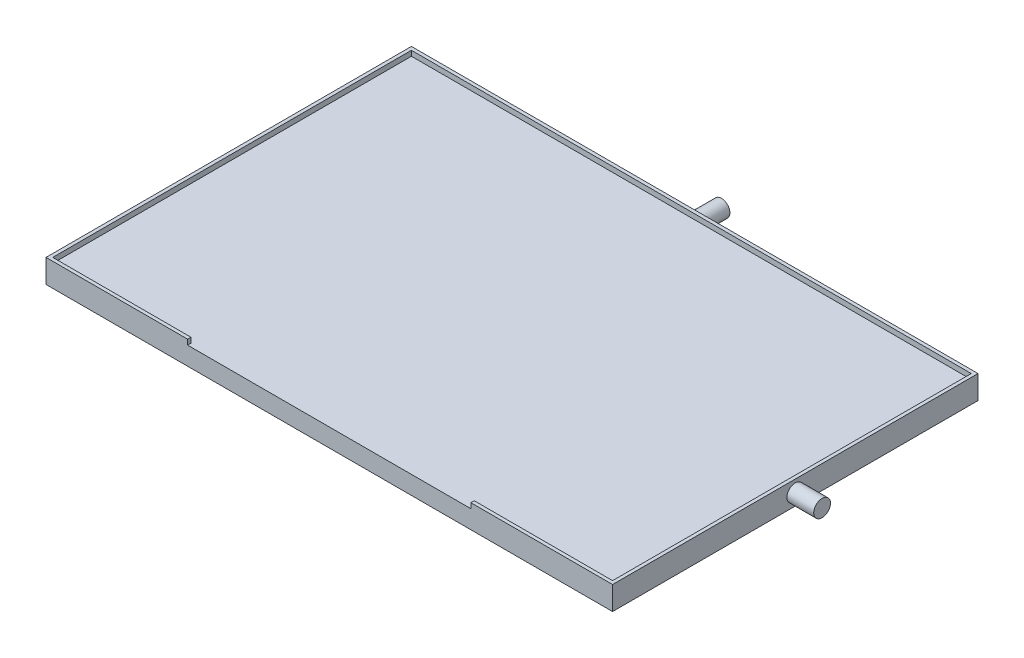
ISO-10303-21;
HEADER;
FILE_DESCRIPTION(('STEP AP214'),'2;1');
FILE_NAME('part.step','',(''),(''),'','','');
FILE_SCHEMA(('AUTOMOTIVE_DESIGN { 1 0 10303 214 1 1 1 1 }'));
ENDSEC;
DATA;
#1=APPLICATION_CONTEXT('core data for automotive mechanical design processes');
#2=APPLICATION_PROTOCOL_DEFINITION('international standard','automotive_design',2000,#1);
#3=PRODUCT_CONTEXT('',#1,'mechanical');
#4=PRODUCT('Part','Part','',(#3));
#5=PRODUCT_RELATED_PRODUCT_CATEGORY('part','',(#4));
#6=PRODUCT_DEFINITION_FORMATION('','',#4);
#7=PRODUCT_DEFINITION_CONTEXT('part definition',#1,'design');
#8=PRODUCT_DEFINITION('design','',#6,#7);
#9=PRODUCT_DEFINITION_SHAPE('','',#8);
#10=(LENGTH_UNIT() NAMED_UNIT(*) SI_UNIT(.MILLI.,.METRE.));
#11=(NAMED_UNIT(*) PLANE_ANGLE_UNIT() SI_UNIT($,.RADIAN.));
#12=(NAMED_UNIT(*) SI_UNIT($,.STERADIAN.) SOLID_ANGLE_UNIT());
#13=UNCERTAINTY_MEASURE_WITH_UNIT(LENGTH_MEASURE(1.E-05),#10,'distance_accuracy_value','');
#14=(GEOMETRIC_REPRESENTATION_CONTEXT(3) GLOBAL_UNCERTAINTY_ASSIGNED_CONTEXT((#13)) GLOBAL_UNIT_ASSIGNED_CONTEXT((#10,
#11,#12)) REPRESENTATION_CONTEXT('',''));
#15=CARTESIAN_POINT('',(0.,0.,0.));
#16=DIRECTION('',(0.,0.,1.));
#17=DIRECTION('',(1.,0.,0.));
#18=AXIS2_PLACEMENT_3D('',#15,#16,#17);
#19=CARTESIAN_POINT('',(0.,-10.,0.));
#20=DIRECTION('',(0.,1.,0.));
#21=DIRECTION('',(0.,0.,1.));
#22=AXIS2_PLACEMENT_3D('',#19,#20,#21);
#23=PLANE('',#22);
#24=DIRECTION('',(-1.,0.,0.));
#25=VECTOR('',#24,1.);
#26=CARTESIAN_POINT('',(104.6,-10.,-57.05));
#27=LINE('',#26,#25);
#28=CARTESIAN_POINT('',(99.5,-10.,-57.05));
#29=VERTEX_POINT('',#28);
#30=CARTESIAN_POINT('',(104.6,-10.,-57.05));
#31=VERTEX_POINT('',#30);
#32=EDGE_CURVE('E255',#29,#31,#27,.F.);
#33=ORIENTED_EDGE('',*,*,#32,.F.);
#34=DIRECTION('',(0.,0.,-1.));
#35=VECTOR('',#34,1.);
#36=CARTESIAN_POINT('',(99.5,-10.,-62.));
#37=LINE('',#36,#35);
#38=CARTESIAN_POINT('',(99.5,-10.,-62.));
#39=VERTEX_POINT('',#38);
#40=EDGE_CURVE('E295',#29,#39,#37,.T.);
#41=ORIENTED_EDGE('',*,*,#40,.T.);
#42=DIRECTION('',(1.,0.,0.));
#43=VECTOR('',#42,1.);
#44=CARTESIAN_POINT('',(99.5,-10.,-62.));
#45=LINE('',#44,#43);
#46=CARTESIAN_POINT('',(109.5,-10.,-62.));
#47=VERTEX_POINT('',#46);
#48=EDGE_CURVE('E299',#39,#47,#45,.T.);
#49=ORIENTED_EDGE('',*,*,#48,.T.);
#50=DIRECTION('',(0.,0.,1.));
#51=VECTOR('',#50,1.);
#52=CARTESIAN_POINT('',(109.5,-10.,-62.));
#53=LINE('',#52,#51);
#54=CARTESIAN_POINT('',(109.5,-10.,-47.));
#55=VERTEX_POINT('',#54);
#56=EDGE_CURVE('E289',#47,#55,#53,.T.);
#57=ORIENTED_EDGE('',*,*,#56,.T.);
#58=DIRECTION('',(-1.,0.,0.));
#59=VECTOR('',#58,1.);
#60=CARTESIAN_POINT('',(99.5,-10.,-47.));
#61=LINE('',#60,#59);
#62=CARTESIAN_POINT('',(99.5,-10.,-47.));
#63=VERTEX_POINT('',#62);
#64=EDGE_CURVE('E292',#55,#63,#61,.T.);
#65=ORIENTED_EDGE('',*,*,#64,.T.);
#66=CARTESIAN_POINT('',(99.5,-10.,-51.95));
#67=VERTEX_POINT('',#66);
#68=EDGE_CURVE('E296',#63,#67,#37,.T.);
#69=ORIENTED_EDGE('',*,*,#68,.T.);
#70=DIRECTION('',(-1.,0.,0.));
#71=VECTOR('',#70,1.);
#72=CARTESIAN_POINT('',(104.6,-10.,-51.95));
#73=LINE('',#72,#71);
#74=CARTESIAN_POINT('',(104.6,-10.,-51.95));
#75=VERTEX_POINT('',#74);
#76=EDGE_CURVE('E251',#75,#67,#73,.T.);
#77=ORIENTED_EDGE('',*,*,#76,.F.);
#78=DIRECTION('',(0.,0.,-1.));
#79=VECTOR('',#78,1.);
#80=CARTESIAN_POINT('',(104.6,-10.,0.));
#81=LINE('',#80,#79);
#82=EDGE_CURVE('E11',#75,#31,#81,.T.);
#83=ORIENTED_EDGE('',*,*,#82,.T.);
#84=EDGE_LOOP('',(#33,#41,#49,#57,#65,#69,#77,#83));
#85=FACE_BOUND('',#84,.T.);
#86=ADVANCED_FACE('F35',(#85),#23,.F.);
#87=CARTESIAN_POINT('',(0.,-10.,0.));
#88=DIRECTION('',(0.,-1.,0.));
#89=DIRECTION('',(0.,0.,-1.));
#90=AXIS2_PLACEMENT_3D('',#87,#88,#89);
#91=PLANE('',#90);
#92=DIRECTION('',(0.,0.,1.));
#93=VECTOR('',#92,1.);
#94=CARTESIAN_POINT('',(64.4,-10.,0.));
#95=LINE('',#94,#93);
#96=CARTESIAN_POINT('',(64.4,-10.,-57.05));
#97=VERTEX_POINT('',#96);
#98=CARTESIAN_POINT('',(64.4,-10.,-51.95));
#99=VERTEX_POINT('',#98);
#100=EDGE_CURVE('E377',#97,#99,#95,.T.);
#101=ORIENTED_EDGE('',*,*,#100,.T.);
#102=DIRECTION('',(-1.,0.,0.));
#103=VECTOR('',#102,1.);
#104=CARTESIAN_POINT('',(104.6,-10.,-51.95));
#105=LINE('',#104,#103);
#106=CARTESIAN_POINT('',(69.5,-10.,-51.95));
#107=VERTEX_POINT('',#106);
#108=EDGE_CURVE('E43',#99,#107,#105,.F.);
#109=ORIENTED_EDGE('',*,*,#108,.T.);
#110=DIRECTION('',(0.,0.,1.));
#111=VECTOR('',#110,1.);
#112=CARTESIAN_POINT('',(69.5,-10.,-62.));
#113=LINE('',#112,#111);
#114=CARTESIAN_POINT('',(69.5,-10.,-47.));
#115=VERTEX_POINT('',#114);
#116=EDGE_CURVE('E264',#107,#115,#113,.T.);
#117=ORIENTED_EDGE('',*,*,#116,.T.);
#118=DIRECTION('',(-1.,0.,0.));
#119=VECTOR('',#118,1.);
#120=CARTESIAN_POINT('',(69.5,-10.,-47.));
#121=LINE('',#120,#119);
#122=CARTESIAN_POINT('',(59.5,-10.,-47.));
#123=VERTEX_POINT('',#122);
#124=EDGE_CURVE('E268',#115,#123,#121,.T.);
#125=ORIENTED_EDGE('',*,*,#124,.T.);
#126=DIRECTION('',(0.,0.,-1.));
#127=VECTOR('',#126,1.);
#128=CARTESIAN_POINT('',(59.5,-10.,-62.));
#129=LINE('',#128,#127);
#130=CARTESIAN_POINT('',(59.5,-10.,-62.));
#131=VERTEX_POINT('',#130);
#132=EDGE_CURVE('E258',#123,#131,#129,.T.);
#133=ORIENTED_EDGE('',*,*,#132,.T.);
#134=DIRECTION('',(1.,0.,0.));
#135=VECTOR('',#134,1.);
#136=CARTESIAN_POINT('',(69.5,-10.,-62.));
#137=LINE('',#136,#135);
#138=CARTESIAN_POINT('',(69.5,-10.,-62.));
#139=VERTEX_POINT('',#138);
#140=EDGE_CURVE('E261',#131,#139,#137,.T.);
#141=ORIENTED_EDGE('',*,*,#140,.T.);
#142=CARTESIAN_POINT('',(69.5,-10.,-57.05));
#143=VERTEX_POINT('',#142);
#144=EDGE_CURVE('E265',#139,#143,#113,.T.);
#145=ORIENTED_EDGE('',*,*,#144,.T.);
#146=DIRECTION('',(-1.,0.,0.));
#147=VECTOR('',#146,1.);
#148=CARTESIAN_POINT('',(104.6,-10.,-57.05));
#149=LINE('',#148,#147);
#150=EDGE_CURVE('E385',#143,#97,#149,.T.);
#151=ORIENTED_EDGE('',*,*,#150,.T.);
#152=EDGE_LOOP('',(#101,#109,#117,#125,#133,#141,#145,#151));
#153=FACE_BOUND('',#152,.T.);
#154=ADVANCED_FACE('F390',(#153),#91,.T.);
#155=CARTESIAN_POINT('',(0.,0.,-109.));
#156=DIRECTION('',(0.,-1.,0.));
#157=DIRECTION('',(0.,0.,-1.));
#158=AXIS2_PLACEMENT_3D('',#155,#156,#157);
#159=PLANE('',#158);
#160=DIRECTION('',(1.,0.,0.));
#161=VECTOR('',#160,1.);
#162=CARTESIAN_POINT('',(0.,0.,0.));
#163=LINE('',#162,#161);
#164=CARTESIAN_POINT('',(0.,0.,0.));
#165=VERTEX_POINT('',#164);
#166=CARTESIAN_POINT('',(169.,0.,0.));
#167=VERTEX_POINT('',#166);
#168=EDGE_CURVE('E365',#165,#167,#163,.T.);
#169=ORIENTED_EDGE('',*,*,#168,.F.);
#170=DIRECTION('',(0.,0.,1.));
#171=VECTOR('',#170,1.);
#172=CARTESIAN_POINT('',(0.,0.,-109.));
#173=LINE('',#172,#171);
#174=CARTESIAN_POINT('',(0.,0.,-109.));
#175=VERTEX_POINT('',#174);
#176=EDGE_CURVE('E362',#175,#165,#173,.T.);
#177=ORIENTED_EDGE('',*,*,#176,.F.);
#178=DIRECTION('',(1.,0.,0.));
#179=VECTOR('',#178,1.);
#180=CARTESIAN_POINT('',(0.,0.,-109.));
#181=LINE('',#180,#179);
#182=CARTESIAN_POINT('',(169.,0.,-109.));
#183=VERTEX_POINT('',#182);
#184=EDGE_CURVE('E352',#175,#183,#181,.T.);
#185=ORIENTED_EDGE('',*,*,#184,.T.);
#186=DIRECTION('',(0.,0.,1.));
#187=VECTOR('',#186,1.);
#188=CARTESIAN_POINT('',(169.,0.,-109.));
#189=LINE('',#188,#187);
#190=EDGE_CURVE('E380',#183,#167,#189,.T.);
#191=ORIENTED_EDGE('',*,*,#190,.T.);
#192=EDGE_LOOP('',(#169,#177,#185,#191));
#193=FACE_BOUND('',#192,.T.);
#194=DIRECTION('',(-1.,0.,0.));
#195=VECTOR('',#194,1.);
#196=CARTESIAN_POINT('',(99.5,0.,-47.));
#197=LINE('',#196,#195);
#198=CARTESIAN_POINT('',(109.5,0.,-47.));
#199=VERTEX_POINT('',#198);
#200=CARTESIAN_POINT('',(99.5,0.,-47.));
#201=VERTEX_POINT('',#200);
#202=EDGE_CURVE('E304',#199,#201,#197,.T.);
#203=ORIENTED_EDGE('',*,*,#202,.F.);
#204=DIRECTION('',(0.,0.,1.));
#205=VECTOR('',#204,1.);
#206=CARTESIAN_POINT('',(109.5,0.,-62.));
#207=LINE('',#206,#205);
#208=CARTESIAN_POINT('',(109.5,0.,-62.));
#209=VERTEX_POINT('',#208);
#210=EDGE_CURVE('E288',#209,#199,#207,.T.);
#211=ORIENTED_EDGE('',*,*,#210,.F.);
#212=DIRECTION('',(1.,0.,0.));
#213=VECTOR('',#212,1.);
#214=CARTESIAN_POINT('',(99.5,0.,-62.));
#215=LINE('',#214,#213);
#216=CARTESIAN_POINT('',(99.5,0.,-62.));
#217=VERTEX_POINT('',#216);
#218=EDGE_CURVE('E293',#217,#209,#215,.T.);
#219=ORIENTED_EDGE('',*,*,#218,.F.);
#220=DIRECTION('',(0.,0.,-1.));
#221=VECTOR('',#220,1.);
#222=CARTESIAN_POINT('',(99.5,0.,-62.));
#223=LINE('',#222,#221);
#224=EDGE_CURVE('E306',#201,#217,#223,.T.);
#225=ORIENTED_EDGE('',*,*,#224,.F.);
#226=EDGE_LOOP('',(#203,#211,#219,#225));
#227=FACE_BOUND('',#226,.T.);
#228=DIRECTION('',(1.,0.,0.));
#229=VECTOR('',#228,1.);
#230=CARTESIAN_POINT('',(69.5,0.,-62.));
#231=LINE('',#230,#229);
#232=CARTESIAN_POINT('',(59.5,0.,-62.));
#233=VERTEX_POINT('',#232);
#234=CARTESIAN_POINT('',(69.5,0.,-62.));
#235=VERTEX_POINT('',#234);
#236=EDGE_CURVE('E273',#233,#235,#231,.T.);
#237=ORIENTED_EDGE('',*,*,#236,.F.);
#238=DIRECTION('',(0.,0.,-1.));
#239=VECTOR('',#238,1.);
#240=CARTESIAN_POINT('',(59.5,0.,-62.));
#241=LINE('',#240,#239);
#242=CARTESIAN_POINT('',(59.5,0.,-47.));
#243=VERTEX_POINT('',#242);
#244=EDGE_CURVE('E257',#243,#233,#241,.T.);
#245=ORIENTED_EDGE('',*,*,#244,.F.);
#246=DIRECTION('',(-1.,0.,0.));
#247=VECTOR('',#246,1.);
#248=CARTESIAN_POINT('',(69.5,0.,-47.));
#249=LINE('',#248,#247);
#250=CARTESIAN_POINT('',(69.5,0.,-47.));
#251=VERTEX_POINT('',#250);
#252=EDGE_CURVE('E262',#251,#243,#249,.T.);
#253=ORIENTED_EDGE('',*,*,#252,.F.);
#254=DIRECTION('',(0.,0.,1.));
#255=VECTOR('',#254,1.);
#256=CARTESIAN_POINT('',(69.5,0.,-62.));
#257=LINE('',#256,#255);
#258=EDGE_CURVE('E275',#235,#251,#257,.T.);
#259=ORIENTED_EDGE('',*,*,#258,.F.);
#260=EDGE_LOOP('',(#237,#245,#253,#259));
#261=FACE_BOUND('',#260,.T.);
#262=ADVANCED_FACE('F434',(#193,#227,#261),#159,.T.);
#263=CARTESIAN_POINT('',(0.,0.,-109.));
#264=DIRECTION('',(-1.,0.,0.));
#265=DIRECTION('',(0.,0.,1.));
#266=AXIS2_PLACEMENT_3D('',#263,#264,#265);
#267=PLANE('',#266);
#268=DIRECTION('',(0.,-1.,0.));
#269=VECTOR('',#268,1.);
#270=CARTESIAN_POINT('',(0.,0.,0.));
#271=LINE('',#270,#269);
#272=CARTESIAN_POINT('',(0.,7.00000000000001,0.));
#273=VERTEX_POINT('',#272);
#274=EDGE_CURVE('E343',#273,#165,#271,.T.);
#275=ORIENTED_EDGE('',*,*,#274,.F.);
#276=DIRECTION('',(0.,0.,1.));
#277=VECTOR('',#276,1.);
#278=CARTESIAN_POINT('',(0.,7.00000000000001,-109.));
#279=LINE('',#278,#277);
#280=CARTESIAN_POINT('',(0.,7.00000000000001,-109.));
#281=VERTEX_POINT('',#280);
#282=EDGE_CURVE('E374',#281,#273,#279,.T.);
#283=ORIENTED_EDGE('',*,*,#282,.F.);
#284=DIRECTION('',(0.,-1.,0.));
#285=VECTOR('',#284,1.);
#286=CARTESIAN_POINT('',(0.,0.,-109.));
#287=LINE('',#286,#285);
#288=EDGE_CURVE('E349',#281,#175,#287,.T.);
#289=ORIENTED_EDGE('',*,*,#288,.T.);
#290=ORIENTED_EDGE('',*,*,#176,.T.);
#291=EDGE_LOOP('',(#275,#283,#289,#290));
#292=FACE_BOUND('',#291,.T.);
#293=ADVANCED_FACE('F37',(#292),#267,.T.);
#294=CARTESIAN_POINT('',(0.,7.00000000000001,-109.));
#295=DIRECTION('',(0.,1.,0.));
#296=DIRECTION('',(-1.,0.,0.));
#297=AXIS2_PLACEMENT_3D('',#294,#295,#296);
#298=PLANE('',#297);
#299=DIRECTION('',(1.,0.,0.));
#300=VECTOR('',#299,1.);
#301=CARTESIAN_POINT('',(0.999999999999987,7.00000000000001,-1.00000000000001));
#302=LINE('',#301,#300);
#303=CARTESIAN_POINT('',(126.75,7.,-1.00000000000001));
#304=VERTEX_POINT('',#303);
#305=CARTESIAN_POINT('',(168.,7.,-1.00000000000001));
#306=VERTEX_POINT('',#305);
#307=EDGE_CURVE('E233',#304,#306,#302,.T.);
#308=ORIENTED_EDGE('',*,*,#307,.F.);
#309=DIRECTION('',(0.,0.,1.));
#310=VECTOR('',#309,1.);
#311=CARTESIAN_POINT('',(126.75,7.,-2.));
#312=LINE('',#311,#310);
#313=CARTESIAN_POINT('',(126.75,7.,0.));
#314=VERTEX_POINT('',#313);
#315=EDGE_CURVE('E344',#304,#314,#312,.T.);
#316=ORIENTED_EDGE('',*,*,#315,.T.);
#317=DIRECTION('',(-1.,0.,0.));
#318=VECTOR('',#317,1.);
#319=CARTESIAN_POINT('',(0.,7.00000000000001,0.));
#320=LINE('',#319,#318);
#321=CARTESIAN_POINT('',(169.,7.,0.));
#322=VERTEX_POINT('',#321);
#323=EDGE_CURVE('E353',#322,#314,#320,.T.);
#324=ORIENTED_EDGE('',*,*,#323,.F.);
#325=DIRECTION('',(0.,0.,1.));
#326=VECTOR('',#325,1.);
#327=CARTESIAN_POINT('',(169.,7.,-109.));
#328=LINE('',#327,#326);
#329=CARTESIAN_POINT('',(169.,7.,-109.));
#330=VERTEX_POINT('',#329);
#331=EDGE_CURVE('E378',#330,#322,#328,.T.);
#332=ORIENTED_EDGE('',*,*,#331,.F.);
#333=DIRECTION('',(-1.,0.,0.));
#334=VECTOR('',#333,1.);
#335=CARTESIAN_POINT('',(0.,7.00000000000001,-109.));
#336=LINE('',#335,#334);
#337=EDGE_CURVE('E359',#330,#281,#336,.T.);
#338=ORIENTED_EDGE('',*,*,#337,.T.);
#339=ORIENTED_EDGE('',*,*,#282,.T.);
#340=CARTESIAN_POINT('',(42.25,7.,0.));
#341=VERTEX_POINT('',#340);
#342=EDGE_CURVE('E371',#341,#273,#320,.T.);
#343=ORIENTED_EDGE('',*,*,#342,.F.);
#344=DIRECTION('',(0.,0.,1.));
#345=VECTOR('',#344,1.);
#346=CARTESIAN_POINT('',(42.25,7.,-2.));
#347=LINE('',#346,#345);
#348=CARTESIAN_POINT('',(42.25,7.,-1.00000000000001));
#349=VERTEX_POINT('',#348);
#350=EDGE_CURVE('E341',#349,#341,#347,.T.);
#351=ORIENTED_EDGE('',*,*,#350,.F.);
#352=CARTESIAN_POINT('',(0.999999999999987,7.00000000000001,-1.00000000000001));
#353=VERTEX_POINT('',#352);
#354=EDGE_CURVE('E234',#353,#349,#302,.T.);
#355=ORIENTED_EDGE('',*,*,#354,.F.);
#356=DIRECTION('',(0.,0.,-1.));
#357=VECTOR('',#356,1.);
#358=CARTESIAN_POINT('',(0.999999999999987,7.00000000000001,-1.00000000000001));
#359=LINE('',#358,#357);
#360=CARTESIAN_POINT('',(0.999999999999987,7.00000000000001,-108.));
#361=VERTEX_POINT('',#360);
#362=EDGE_CURVE('E207',#353,#361,#359,.T.);
#363=ORIENTED_EDGE('',*,*,#362,.T.);
#364=DIRECTION('',(1.,0.,0.));
#365=VECTOR('',#364,1.);
#366=CARTESIAN_POINT('',(0.999999999999987,7.00000000000001,-108.));
#367=LINE('',#366,#365);
#368=CARTESIAN_POINT('',(168.,7.,-108.));
#369=VERTEX_POINT('',#368);
#370=EDGE_CURVE('E230',#361,#369,#367,.T.);
#371=ORIENTED_EDGE('',*,*,#370,.T.);
#372=DIRECTION('',(0.,0.,-1.));
#373=VECTOR('',#372,1.);
#374=CARTESIAN_POINT('',(168.,7.,-1.00000000000001));
#375=LINE('',#374,#373);
#376=EDGE_CURVE('E214',#306,#369,#375,.T.);
#377=ORIENTED_EDGE('',*,*,#376,.F.);
#378=EDGE_LOOP('',(#308,#316,#324,#332,#338,#339,#343,#351,#355,#363,#371,#377));
#379=FACE_BOUND('',#378,.T.);
#380=ADVANCED_FACE('F490',(#379),#298,.T.);
#381=CARTESIAN_POINT('',(169.,0.,-109.));
#382=DIRECTION('',(1.,0.,0.));
#383=DIRECTION('',(0.,0.,-1.));
#384=AXIS2_PLACEMENT_3D('',#381,#382,#383);
#385=PLANE('',#384);
#386=CARTESIAN_POINT('',(169.,3.5,-54.5));
#387=DIRECTION('',(1.,0.,0.));
#388=DIRECTION('',(0.,0.,-1.));
#389=AXIS2_PLACEMENT_3D('',#386,#387,#388);
#390=CIRCLE('',#389,2.5);
#391=CARTESIAN_POINT('',(169.,3.5,-57.));
#392=VERTEX_POINT('',#391);
#393=EDGE_CURVE('E323',#392,#392,#390,.T.);
#394=ORIENTED_EDGE('',*,*,#393,.F.);
#395=EDGE_LOOP('',(#394));
#396=FACE_BOUND('',#395,.T.);
#397=DIRECTION('',(0.,1.,0.));
#398=VECTOR('',#397,1.);
#399=CARTESIAN_POINT('',(169.,0.,0.));
#400=LINE('',#399,#398);
#401=EDGE_CURVE('E368',#167,#322,#400,.T.);
#402=ORIENTED_EDGE('',*,*,#401,.F.);
#403=ORIENTED_EDGE('',*,*,#190,.F.);
#404=DIRECTION('',(0.,1.,0.));
#405=VECTOR('',#404,1.);
#406=CARTESIAN_POINT('',(169.,0.,-109.));
#407=LINE('',#406,#405);
#408=EDGE_CURVE('E356',#183,#330,#407,.T.);
#409=ORIENTED_EDGE('',*,*,#408,.T.);
#410=ORIENTED_EDGE('',*,*,#331,.T.);
#411=EDGE_LOOP('',(#402,#403,#409,#410));
#412=FACE_BOUND('',#411,.T.);
#413=ADVANCED_FACE('F485',(#396,#412),#385,.T.);
#414=CARTESIAN_POINT('',(0.,0.,-109.));
#415=DIRECTION('',(0.,0.,-1.));
#416=DIRECTION('',(-1.,0.,0.));
#417=AXIS2_PLACEMENT_3D('',#414,#415,#416);
#418=PLANE('',#417);
#419=CARTESIAN_POINT('',(84.5,3.5,-109.));
#420=DIRECTION('',(0.,0.,-1.));
#421=DIRECTION('',(-1.,0.,0.));
#422=AXIS2_PLACEMENT_3D('',#419,#420,#421);
#423=CIRCLE('',#422,2.50000000000001);
#424=CARTESIAN_POINT('',(82.,3.5,-109.));
#425=VERTEX_POINT('',#424);
#426=EDGE_CURVE('E319',#425,#425,#423,.T.);
#427=ORIENTED_EDGE('',*,*,#426,.F.);
#428=EDGE_LOOP('',(#427));
#429=FACE_BOUND('',#428,.T.);
#430=ORIENTED_EDGE('',*,*,#288,.F.);
#431=ORIENTED_EDGE('',*,*,#337,.F.);
#432=ORIENTED_EDGE('',*,*,#408,.F.);
#433=ORIENTED_EDGE('',*,*,#184,.F.);
#434=EDGE_LOOP('',(#430,#431,#432,#433));
#435=FACE_BOUND('',#434,.T.);
#436=ADVANCED_FACE('F482',(#429,#435),#418,.T.);
#437=CARTESIAN_POINT('',(0.,0.,0.));
#438=DIRECTION('',(0.,0.,-1.));
#439=DIRECTION('',(-1.,0.,0.));
#440=AXIS2_PLACEMENT_3D('',#437,#438,#439);
#441=PLANE('',#440);
#442=DIRECTION('',(1.,0.,0.));
#443=VECTOR('',#442,1.);
#444=CARTESIAN_POINT('',(42.25,5.45,0.));
#445=LINE('',#444,#443);
#446=CARTESIAN_POINT('',(42.25,5.45,0.));
#447=VERTEX_POINT('',#446);
#448=CARTESIAN_POINT('',(126.75,5.45,0.));
#449=VERTEX_POINT('',#448);
#450=EDGE_CURVE('E334',#447,#449,#445,.T.);
#451=ORIENTED_EDGE('',*,*,#450,.F.);
#452=DIRECTION('',(0.,-1.,0.));
#453=VECTOR('',#452,1.);
#454=CARTESIAN_POINT('',(42.25,7.,0.));
#455=LINE('',#454,#453);
#456=EDGE_CURVE('E329',#341,#447,#455,.T.);
#457=ORIENTED_EDGE('',*,*,#456,.F.);
#458=ORIENTED_EDGE('',*,*,#342,.T.);
#459=ORIENTED_EDGE('',*,*,#274,.T.);
#460=ORIENTED_EDGE('',*,*,#168,.T.);
#461=ORIENTED_EDGE('',*,*,#401,.T.);
#462=ORIENTED_EDGE('',*,*,#323,.T.);
#463=DIRECTION('',(0.,1.,0.));
#464=VECTOR('',#463,1.);
#465=CARTESIAN_POINT('',(126.75,7.,0.));
#466=LINE('',#465,#464);
#467=EDGE_CURVE('E337',#449,#314,#466,.T.);
#468=ORIENTED_EDGE('',*,*,#467,.F.);
#469=EDGE_LOOP('',(#451,#457,#458,#459,#460,#461,#462,#468));
#470=FACE_BOUND('',#469,.T.);
#471=ADVANCED_FACE('F480',(#470),#441,.F.);
#472=CARTESIAN_POINT('',(42.25,7.,-2.));
#473=DIRECTION('',(-1.,0.,0.));
#474=DIRECTION('',(0.,-1.,0.));
#475=AXIS2_PLACEMENT_3D('',#472,#473,#474);
#476=PLANE('',#475);
#477=DIRECTION('',(0.,0.,1.));
#478=VECTOR('',#477,1.);
#479=CARTESIAN_POINT('',(42.25,5.45,-2.));
#480=LINE('',#479,#478);
#481=CARTESIAN_POINT('',(42.25,5.45,-1.00000000000001));
#482=VERTEX_POINT('',#481);
#483=EDGE_CURVE('E340',#482,#447,#480,.T.);
#484=ORIENTED_EDGE('',*,*,#483,.F.);
#485=DIRECTION('',(0.,1.,0.));
#486=VECTOR('',#485,1.);
#487=CARTESIAN_POINT('',(42.25,7.,-1.00000000000001));
#488=LINE('',#487,#486);
#489=EDGE_CURVE('E244',#482,#349,#488,.T.);
#490=ORIENTED_EDGE('',*,*,#489,.T.);
#491=ORIENTED_EDGE('',*,*,#350,.T.);
#492=ORIENTED_EDGE('',*,*,#456,.T.);
#493=EDGE_LOOP('',(#484,#490,#491,#492));
#494=FACE_BOUND('',#493,.T.);
#495=ADVANCED_FACE('F474',(#494),#476,.F.);
#496=CARTESIAN_POINT('',(126.75,7.,-2.));
#497=DIRECTION('',(1.,0.,0.));
#498=DIRECTION('',(0.,0.,-1.));
#499=AXIS2_PLACEMENT_3D('',#496,#497,#498);
#500=PLANE('',#499);
#501=ORIENTED_EDGE('',*,*,#315,.F.);
#502=DIRECTION('',(0.,-1.,0.));
#503=VECTOR('',#502,1.);
#504=CARTESIAN_POINT('',(126.75,7.,-1.00000000000001));
#505=LINE('',#504,#503);
#506=CARTESIAN_POINT('',(126.75,5.45,-1.00000000000001));
#507=VERTEX_POINT('',#506);
#508=EDGE_CURVE('E216',#304,#507,#505,.T.);
#509=ORIENTED_EDGE('',*,*,#508,.T.);
#510=DIRECTION('',(0.,0.,1.));
#511=VECTOR('',#510,1.);
#512=CARTESIAN_POINT('',(126.75,5.45,-2.));
#513=LINE('',#512,#511);
#514=EDGE_CURVE('E346',#507,#449,#513,.T.);
#515=ORIENTED_EDGE('',*,*,#514,.T.);
#516=ORIENTED_EDGE('',*,*,#467,.T.);
#517=EDGE_LOOP('',(#501,#509,#515,#516));
#518=FACE_BOUND('',#517,.T.);
#519=ADVANCED_FACE('F471',(#518),#500,.F.);
#520=CARTESIAN_POINT('',(42.25,5.45,-2.));
#521=DIRECTION('',(0.,-1.,0.));
#522=DIRECTION('',(0.,0.,-1.));
#523=AXIS2_PLACEMENT_3D('',#520,#521,#522);
#524=PLANE('',#523);
#525=DIRECTION('',(1.,0.,0.));
#526=VECTOR('',#525,1.);
#527=CARTESIAN_POINT('',(0.999999999999987,5.45000000000001,-1.00000000000001));
#528=LINE('',#527,#526);
#529=CARTESIAN_POINT('',(0.999999999999987,5.45000000000001,-1.00000000000001));
#530=VERTEX_POINT('',#529);
#531=EDGE_CURVE('E225',#530,#482,#528,.T.);
#532=ORIENTED_EDGE('',*,*,#531,.T.);
#533=ORIENTED_EDGE('',*,*,#483,.T.);
#534=ORIENTED_EDGE('',*,*,#450,.T.);
#535=ORIENTED_EDGE('',*,*,#514,.F.);
#536=CARTESIAN_POINT('',(168.,5.45,-1.00000000000001));
#537=VERTEX_POINT('',#536);
#538=EDGE_CURVE('E222',#507,#537,#528,.T.);
#539=ORIENTED_EDGE('',*,*,#538,.T.);
#540=DIRECTION('',(0.,0.,-1.));
#541=VECTOR('',#540,1.);
#542=CARTESIAN_POINT('',(168.,5.45,-1.00000000000001));
#543=LINE('',#542,#541);
#544=CARTESIAN_POINT('',(168.,5.45,-108.));
#545=VERTEX_POINT('',#544);
#546=EDGE_CURVE('E206',#537,#545,#543,.T.);
#547=ORIENTED_EDGE('',*,*,#546,.T.);
#548=DIRECTION('',(1.,0.,0.));
#549=VECTOR('',#548,1.);
#550=CARTESIAN_POINT('',(0.999999999999987,5.45000000000001,-108.));
#551=LINE('',#550,#549);
#552=CARTESIAN_POINT('',(0.999999999999987,5.45000000000001,-108.));
#553=VERTEX_POINT('',#552);
#554=EDGE_CURVE('E196',#553,#545,#551,.T.);
#555=ORIENTED_EDGE('',*,*,#554,.F.);
#556=DIRECTION('',(0.,0.,-1.));
#557=VECTOR('',#556,1.);
#558=CARTESIAN_POINT('',(0.999999999999987,5.45000000000001,-1.00000000000001));
#559=LINE('',#558,#557);
#560=EDGE_CURVE('E228',#530,#553,#559,.T.);
#561=ORIENTED_EDGE('',*,*,#560,.F.);
#562=EDGE_LOOP('',(#532,#533,#534,#535,#539,#547,#555,#561));
#563=FACE_BOUND('',#562,.T.);
#564=ADVANCED_FACE('F220',(#563),#524,.F.);
#565=CARTESIAN_POINT('',(177.,3.5,-54.5));
#566=DIRECTION('',(-1.,0.,0.));
#567=DIRECTION('',(0.,0.,1.));
#568=AXIS2_PLACEMENT_3D('',#565,#566,#567);
#569=CYLINDRICAL_SURFACE('',#568,2.5);
#570=CARTESIAN_POINT('',(177.,3.5,-54.5));
#571=DIRECTION('',(1.,0.,0.));
#572=DIRECTION('',(0.,0.,-1.));
#573=AXIS2_PLACEMENT_3D('',#570,#571,#572);
#574=CIRCLE('',#573,2.5);
#575=CARTESIAN_POINT('',(177.,3.5,-57.));
#576=VERTEX_POINT('',#575);
#577=EDGE_CURVE('E326',#576,#576,#574,.T.);
#578=ORIENTED_EDGE('',*,*,#577,.F.);
#579=EDGE_LOOP('',(#578));
#580=FACE_BOUND('',#579,.T.);
#581=ORIENTED_EDGE('',*,*,#393,.T.);
#582=EDGE_LOOP('',(#581));
#583=FACE_BOUND('',#582,.T.);
#584=ADVANCED_FACE('F466',(#580,#583),#569,.T.);
#585=CARTESIAN_POINT('',(177.,3.5,-54.5));
#586=DIRECTION('',(1.,0.,0.));
#587=DIRECTION('',(0.,0.,-1.));
#588=AXIS2_PLACEMENT_3D('',#585,#586,#587);
#589=PLANE('',#588);
#590=ORIENTED_EDGE('',*,*,#577,.T.);
#591=EDGE_LOOP('',(#590));
#592=FACE_BOUND('',#591,.T.);
#593=ADVANCED_FACE('F462',(#592),#589,.T.);
#594=CARTESIAN_POINT('',(84.5,3.5,-117.));
#595=DIRECTION('',(0.,0.,1.));
#596=DIRECTION('',(1.,0.,0.));
#597=AXIS2_PLACEMENT_3D('',#594,#595,#596);
#598=CYLINDRICAL_SURFACE('',#597,2.50000000000001);
#599=CARTESIAN_POINT('',(84.5,3.5,-117.));
#600=DIRECTION('',(0.,0.,-1.));
#601=DIRECTION('',(-1.,0.,0.));
#602=AXIS2_PLACEMENT_3D('',#599,#600,#601);
#603=CIRCLE('',#602,2.50000000000001);
#604=CARTESIAN_POINT('',(82.,3.5,-117.));
#605=VERTEX_POINT('',#604);
#606=EDGE_CURVE('E320',#605,#605,#603,.T.);
#607=ORIENTED_EDGE('',*,*,#606,.F.);
#608=EDGE_LOOP('',(#607));
#609=FACE_BOUND('',#608,.T.);
#610=ORIENTED_EDGE('',*,*,#426,.T.);
#611=EDGE_LOOP('',(#610));
#612=FACE_BOUND('',#611,.T.);
#613=ADVANCED_FACE('F458',(#609,#612),#598,.T.);
#614=CARTESIAN_POINT('',(84.5,3.5,-117.));
#615=DIRECTION('',(0.,0.,-1.));
#616=DIRECTION('',(-1.,0.,0.));
#617=AXIS2_PLACEMENT_3D('',#614,#615,#616);
#618=PLANE('',#617);
#619=ORIENTED_EDGE('',*,*,#606,.T.);
#620=EDGE_LOOP('',(#619));
#621=FACE_BOUND('',#620,.T.);
#622=ADVANCED_FACE('F454',(#621),#618,.T.);
#623=CARTESIAN_POINT('',(109.5,-10.,-62.));
#624=DIRECTION('',(-1.,0.,0.));
#625=DIRECTION('',(0.,0.,1.));
#626=AXIS2_PLACEMENT_3D('',#623,#624,#625);
#627=PLANE('',#626);
#628=ORIENTED_EDGE('',*,*,#210,.T.);
#629=DIRECTION('',(0.,1.,0.));
#630=VECTOR('',#629,1.);
#631=CARTESIAN_POINT('',(109.5,-10.,-47.));
#632=LINE('',#631,#630);
#633=EDGE_CURVE('E317',#55,#199,#632,.T.);
#634=ORIENTED_EDGE('',*,*,#633,.F.);
#635=ORIENTED_EDGE('',*,*,#56,.F.);
#636=DIRECTION('',(0.,1.,0.));
#637=VECTOR('',#636,1.);
#638=CARTESIAN_POINT('',(109.5,-10.,-62.));
#639=LINE('',#638,#637);
#640=EDGE_CURVE('E301',#47,#209,#639,.T.);
#641=ORIENTED_EDGE('',*,*,#640,.T.);
#642=EDGE_LOOP('',(#628,#634,#635,#641));
#643=FACE_BOUND('',#642,.T.);
#644=ADVANCED_FACE('F450',(#643),#627,.F.);
#645=CARTESIAN_POINT('',(99.5,-10.,-47.));
#646=DIRECTION('',(0.,0.,-1.));
#647=DIRECTION('',(-1.,0.,0.));
#648=AXIS2_PLACEMENT_3D('',#645,#646,#647);
#649=PLANE('',#648);
#650=ORIENTED_EDGE('',*,*,#202,.T.);
#651=DIRECTION('',(0.,1.,0.));
#652=VECTOR('',#651,1.);
#653=CARTESIAN_POINT('',(99.5,-10.,-47.));
#654=LINE('',#653,#652);
#655=EDGE_CURVE('E314',#63,#201,#654,.T.);
#656=ORIENTED_EDGE('',*,*,#655,.F.);
#657=ORIENTED_EDGE('',*,*,#64,.F.);
#658=ORIENTED_EDGE('',*,*,#633,.T.);
#659=EDGE_LOOP('',(#650,#656,#657,#658));
#660=FACE_BOUND('',#659,.T.);
#661=ADVANCED_FACE('F446',(#660),#649,.F.);
#662=CARTESIAN_POINT('',(99.5,-10.,-62.));
#663=DIRECTION('',(1.,0.,0.));
#664=DIRECTION('',(0.,0.,-1.));
#665=AXIS2_PLACEMENT_3D('',#662,#663,#664);
#666=PLANE('',#665);
#667=CARTESIAN_POINT('',(99.5,-10.,-54.5));
#668=DIRECTION('',(1.,0.,0.));
#669=DIRECTION('',(0.,0.,-1.));
#670=AXIS2_PLACEMENT_3D('',#667,#668,#669);
#671=CIRCLE('',#670,2.55);
#672=EDGE_CURVE('E253',#67,#29,#671,.F.);
#673=ORIENTED_EDGE('',*,*,#672,.F.);
#674=ORIENTED_EDGE('',*,*,#68,.F.);
#675=ORIENTED_EDGE('',*,*,#655,.T.);
#676=ORIENTED_EDGE('',*,*,#224,.T.);
#677=DIRECTION('',(0.,1.,0.));
#678=VECTOR('',#677,1.);
#679=CARTESIAN_POINT('',(99.5,-10.,-62.));
#680=LINE('',#679,#678);
#681=EDGE_CURVE('E312',#39,#217,#680,.T.);
#682=ORIENTED_EDGE('',*,*,#681,.F.);
#683=ORIENTED_EDGE('',*,*,#40,.F.);
#684=EDGE_LOOP('',(#673,#674,#675,#676,#682,#683));
#685=FACE_BOUND('',#684,.T.);
#686=ADVANCED_FACE('F442',(#685),#666,.F.);
#687=CARTESIAN_POINT('',(99.5,-10.,-62.));
#688=DIRECTION('',(0.,0.,1.));
#689=DIRECTION('',(1.,0.,0.));
#690=AXIS2_PLACEMENT_3D('',#687,#688,#689);
#691=PLANE('',#690);
#692=ORIENTED_EDGE('',*,*,#218,.T.);
#693=ORIENTED_EDGE('',*,*,#640,.F.);
#694=ORIENTED_EDGE('',*,*,#48,.F.);
#695=ORIENTED_EDGE('',*,*,#681,.T.);
#696=EDGE_LOOP('',(#692,#693,#694,#695));
#697=FACE_BOUND('',#696,.T.);
#698=ADVANCED_FACE('F439',(#697),#691,.F.);
#699=CARTESIAN_POINT('',(59.5,-10.,-62.));
#700=DIRECTION('',(1.,0.,0.));
#701=DIRECTION('',(0.,0.,-1.));
#702=AXIS2_PLACEMENT_3D('',#699,#700,#701);
#703=PLANE('',#702);
#704=ORIENTED_EDGE('',*,*,#244,.T.);
#705=DIRECTION('',(0.,1.,0.));
#706=VECTOR('',#705,1.);
#707=CARTESIAN_POINT('',(59.5,-10.,-62.));
#708=LINE('',#707,#706);
#709=EDGE_CURVE('E286',#131,#233,#708,.T.);
#710=ORIENTED_EDGE('',*,*,#709,.F.);
#711=ORIENTED_EDGE('',*,*,#132,.F.);
#712=DIRECTION('',(0.,1.,0.));
#713=VECTOR('',#712,1.);
#714=CARTESIAN_POINT('',(59.5,-10.,-47.));
#715=LINE('',#714,#713);
#716=EDGE_CURVE('E270',#123,#243,#715,.T.);
#717=ORIENTED_EDGE('',*,*,#716,.T.);
#718=EDGE_LOOP('',(#704,#710,#711,#717));
#719=FACE_BOUND('',#718,.T.);
#720=ADVANCED_FACE('F407',(#719),#703,.F.);
#721=CARTESIAN_POINT('',(69.5,-10.,-62.));
#722=DIRECTION('',(0.,0.,1.));
#723=DIRECTION('',(1.,0.,0.));
#724=AXIS2_PLACEMENT_3D('',#721,#722,#723);
#725=PLANE('',#724);
#726=ORIENTED_EDGE('',*,*,#236,.T.);
#727=DIRECTION('',(0.,1.,0.));
#728=VECTOR('',#727,1.);
#729=CARTESIAN_POINT('',(69.5,-10.,-62.));
#730=LINE('',#729,#728);
#731=EDGE_CURVE('E283',#139,#235,#730,.T.);
#732=ORIENTED_EDGE('',*,*,#731,.F.);
#733=ORIENTED_EDGE('',*,*,#140,.F.);
#734=ORIENTED_EDGE('',*,*,#709,.T.);
#735=EDGE_LOOP('',(#726,#732,#733,#734));
#736=FACE_BOUND('',#735,.T.);
#737=ADVANCED_FACE('F411',(#736),#725,.F.);
#738=CARTESIAN_POINT('',(69.5,-10.,-62.));
#739=DIRECTION('',(-1.,0.,0.));
#740=DIRECTION('',(0.,0.,1.));
#741=AXIS2_PLACEMENT_3D('',#738,#739,#740);
#742=PLANE('',#741);
#743=CARTESIAN_POINT('',(69.5,-10.,-54.5));
#744=DIRECTION('',(-1.,0.,0.));
#745=DIRECTION('',(0.,0.,1.));
#746=AXIS2_PLACEMENT_3D('',#743,#744,#745);
#747=CIRCLE('',#746,2.55);
#748=EDGE_CURVE('E249',#143,#107,#747,.F.);
#749=ORIENTED_EDGE('',*,*,#748,.F.);
#750=ORIENTED_EDGE('',*,*,#144,.F.);
#751=ORIENTED_EDGE('',*,*,#731,.T.);
#752=ORIENTED_EDGE('',*,*,#258,.T.);
#753=DIRECTION('',(0.,1.,0.));
#754=VECTOR('',#753,1.);
#755=CARTESIAN_POINT('',(69.5,-10.,-47.));
#756=LINE('',#755,#754);
#757=EDGE_CURVE('E281',#115,#251,#756,.T.);
#758=ORIENTED_EDGE('',*,*,#757,.F.);
#759=ORIENTED_EDGE('',*,*,#116,.F.);
#760=EDGE_LOOP('',(#749,#750,#751,#752,#758,#759));
#761=FACE_BOUND('',#760,.T.);
#762=ADVANCED_FACE('F395',(#761),#742,.F.);
#763=CARTESIAN_POINT('',(69.5,-10.,-47.));
#764=DIRECTION('',(0.,0.,-1.));
#765=DIRECTION('',(-1.,0.,0.));
#766=AXIS2_PLACEMENT_3D('',#763,#764,#765);
#767=PLANE('',#766);
#768=ORIENTED_EDGE('',*,*,#252,.T.);
#769=ORIENTED_EDGE('',*,*,#716,.F.);
#770=ORIENTED_EDGE('',*,*,#124,.F.);
#771=ORIENTED_EDGE('',*,*,#757,.T.);
#772=EDGE_LOOP('',(#768,#769,#770,#771));
#773=FACE_BOUND('',#772,.T.);
#774=ADVANCED_FACE('F402',(#773),#767,.F.);
#775=CARTESIAN_POINT('',(64.4,-10.,-54.5));
#776=DIRECTION('',(1.,0.,0.));
#777=DIRECTION('',(0.,0.,-1.));
#778=AXIS2_PLACEMENT_3D('',#775,#776,#777);
#779=PLANE('',#778);
#780=CARTESIAN_POINT('',(64.4,-10.,-54.5));
#781=DIRECTION('',(1.,0.,0.));
#782=DIRECTION('',(0.,0.,-1.));
#783=AXIS2_PLACEMENT_3D('',#780,#781,#782);
#784=CIRCLE('',#783,2.55);
#785=EDGE_CURVE('E56',#97,#99,#784,.T.);
#786=ORIENTED_EDGE('',*,*,#785,.T.);
#787=ORIENTED_EDGE('',*,*,#100,.F.);
#788=EDGE_LOOP('',(#786,#787));
#789=FACE_BOUND('',#788,.T.);
#790=ADVANCED_FACE('F415',(#789),#779,.T.);
#791=CARTESIAN_POINT('',(104.6,-10.,-54.5));
#792=DIRECTION('',(-1.,0.,0.));
#793=DIRECTION('',(0.,0.,1.));
#794=AXIS2_PLACEMENT_3D('',#791,#792,#793);
#795=CYLINDRICAL_SURFACE('',#794,2.55);
#796=ORIENTED_EDGE('',*,*,#785,.F.);
#797=ORIENTED_EDGE('',*,*,#150,.F.);
#798=ORIENTED_EDGE('',*,*,#748,.T.);
#799=ORIENTED_EDGE('',*,*,#108,.F.);
#800=EDGE_LOOP('',(#796,#797,#798,#799));
#801=FACE_BOUND('',#800,.T.);
#802=ADVANCED_FACE('F412',(#801),#795,.F.);
#803=CARTESIAN_POINT('',(104.6,-10.,-54.5));
#804=DIRECTION('',(1.,0.,0.));
#805=DIRECTION('',(0.,0.,-1.));
#806=AXIS2_PLACEMENT_3D('',#803,#804,#805);
#807=PLANE('',#806);
#808=CARTESIAN_POINT('',(104.6,-10.,-54.5));
#809=DIRECTION('',(1.,0.,0.));
#810=DIRECTION('',(0.,0.,-1.));
#811=AXIS2_PLACEMENT_3D('',#808,#809,#810);
#812=CIRCLE('',#811,2.55);
#813=EDGE_CURVE('E49',#31,#75,#812,.T.);
#814=ORIENTED_EDGE('',*,*,#813,.F.);
#815=ORIENTED_EDGE('',*,*,#82,.F.);
#816=EDGE_LOOP('',(#814,#815));
#817=FACE_BOUND('',#816,.T.);
#818=ADVANCED_FACE('F414',(#817),#807,.F.);
#819=ORIENTED_EDGE('',*,*,#32,.T.);
#820=ORIENTED_EDGE('',*,*,#813,.T.);
#821=ORIENTED_EDGE('',*,*,#76,.T.);
#822=ORIENTED_EDGE('',*,*,#672,.T.);
#823=EDGE_LOOP('',(#819,#820,#821,#822));
#824=FACE_BOUND('',#823,.T.);
#825=ADVANCED_FACE('F417',(#824),#795,.F.);
#826=CARTESIAN_POINT('',(0.999999999999987,5.45000000000001,-1.00000000000001));
#827=DIRECTION('',(0.,0.,1.));
#828=DIRECTION('',(1.,0.,0.));
#829=AXIS2_PLACEMENT_3D('',#826,#827,#828);
#830=PLANE('',#829);
#831=ORIENTED_EDGE('',*,*,#531,.F.);
#832=DIRECTION('',(0.,1.,0.));
#833=VECTOR('',#832,1.);
#834=CARTESIAN_POINT('',(0.999999999999987,5.45000000000001,-1.00000000000001));
#835=LINE('',#834,#833);
#836=EDGE_CURVE('E239',#530,#353,#835,.T.);
#837=ORIENTED_EDGE('',*,*,#836,.T.);
#838=ORIENTED_EDGE('',*,*,#354,.T.);
#839=ORIENTED_EDGE('',*,*,#489,.F.);
#840=EDGE_LOOP('',(#831,#837,#838,#839));
#841=FACE_BOUND('',#840,.T.);
#842=ADVANCED_FACE('F426',(#841),#830,.F.);
#843=ORIENTED_EDGE('',*,*,#307,.T.);
#844=DIRECTION('',(0.,1.,0.));
#845=VECTOR('',#844,1.);
#846=CARTESIAN_POINT('',(168.,5.45,-1.00000000000001));
#847=LINE('',#846,#845);
#848=EDGE_CURVE('E217',#537,#306,#847,.T.);
#849=ORIENTED_EDGE('',*,*,#848,.F.);
#850=ORIENTED_EDGE('',*,*,#538,.F.);
#851=ORIENTED_EDGE('',*,*,#508,.F.);
#852=EDGE_LOOP('',(#843,#849,#850,#851));
#853=FACE_BOUND('',#852,.T.);
#854=ADVANCED_FACE('F543',(#853),#830,.F.);
#855=CARTESIAN_POINT('',(0.999999999999987,5.45000000000001,-108.));
#856=DIRECTION('',(0.,0.,1.));
#857=DIRECTION('',(1.,0.,0.));
#858=AXIS2_PLACEMENT_3D('',#855,#856,#857);
#859=PLANE('',#858);
#860=ORIENTED_EDGE('',*,*,#370,.F.);
#861=DIRECTION('',(0.,1.,0.));
#862=VECTOR('',#861,1.);
#863=CARTESIAN_POINT('',(0.999999999999987,5.45000000000001,-108.));
#864=LINE('',#863,#862);
#865=EDGE_CURVE('E202',#553,#361,#864,.T.);
#866=ORIENTED_EDGE('',*,*,#865,.F.);
#867=ORIENTED_EDGE('',*,*,#554,.T.);
#868=DIRECTION('',(0.,1.,0.));
#869=VECTOR('',#868,1.);
#870=CARTESIAN_POINT('',(168.,5.45,-108.));
#871=LINE('',#870,#869);
#872=EDGE_CURVE('E200',#545,#369,#871,.T.);
#873=ORIENTED_EDGE('',*,*,#872,.T.);
#874=EDGE_LOOP('',(#860,#866,#867,#873));
#875=FACE_BOUND('',#874,.T.);
#876=ADVANCED_FACE('F199',(#875),#859,.T.);
#877=CARTESIAN_POINT('',(168.,5.45,-1.00000000000001));
#878=DIRECTION('',(1.,0.,0.));
#879=DIRECTION('',(0.,1.,0.));
#880=AXIS2_PLACEMENT_3D('',#877,#878,#879);
#881=PLANE('',#880);
#882=ORIENTED_EDGE('',*,*,#376,.T.);
#883=ORIENTED_EDGE('',*,*,#872,.F.);
#884=ORIENTED_EDGE('',*,*,#546,.F.);
#885=ORIENTED_EDGE('',*,*,#848,.T.);
#886=EDGE_LOOP('',(#882,#883,#884,#885));
#887=FACE_BOUND('',#886,.T.);
#888=ADVANCED_FACE('F211',(#887),#881,.F.);
#889=CARTESIAN_POINT('',(0.999999999999987,5.45000000000001,-1.00000000000001));
#890=DIRECTION('',(1.,0.,0.));
#891=DIRECTION('',(0.,1.,0.));
#892=AXIS2_PLACEMENT_3D('',#889,#890,#891);
#893=PLANE('',#892);
#894=ORIENTED_EDGE('',*,*,#362,.F.);
#895=ORIENTED_EDGE('',*,*,#836,.F.);
#896=ORIENTED_EDGE('',*,*,#560,.T.);
#897=ORIENTED_EDGE('',*,*,#865,.T.);
#898=EDGE_LOOP('',(#894,#895,#896,#897));
#899=FACE_BOUND('',#898,.T.);
#900=ADVANCED_FACE('F541',(#899),#893,.T.);
#901=CLOSED_SHELL('',(#86,#154,#262,#293,#380,#413,#436,#471,#495,#519,#564,#584,#593,#613,#622,
#644,#661,#686,#698,#720,#737,#762,#774,#790,#802,#818,#825,#842,#854,#876,#888,#900));
#902=MANIFOLD_SOLID_BREP('B2',#901);
#903=ADVANCED_BREP_SHAPE_REPRESENTATION('',(#18,#902),#14);
#904=SHAPE_DEFINITION_REPRESENTATION(#9,#903);
ENDSEC;
END-ISO-10303-21;
